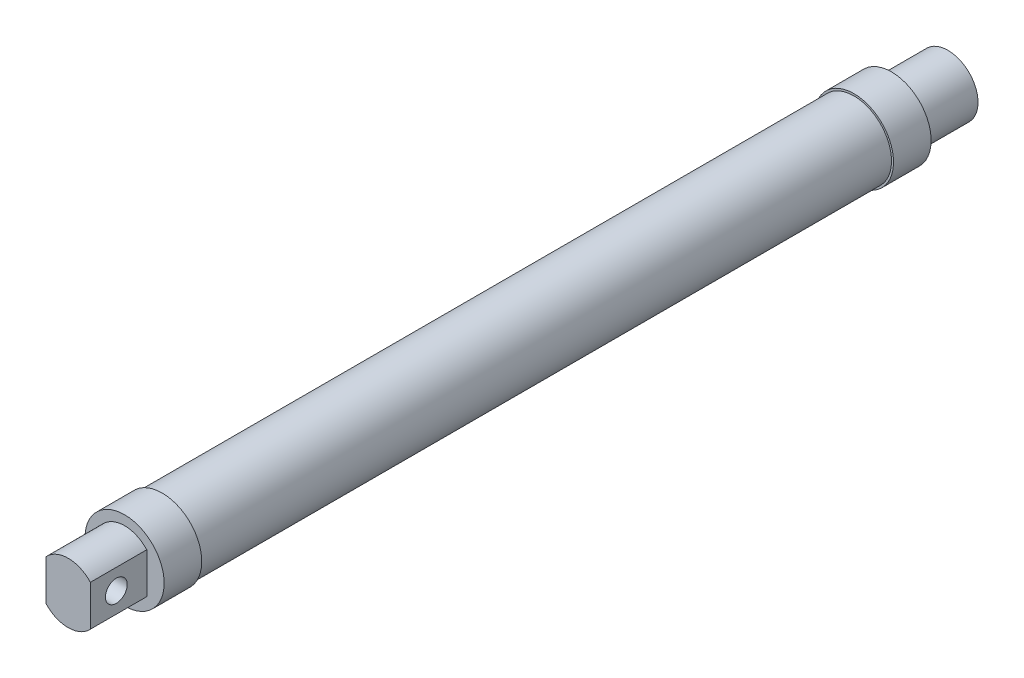
ISO-10303-21;
HEADER;
FILE_DESCRIPTION(('STEP AP214'),'2;1');
FILE_NAME('part.step','',(''),(''),'','','');
FILE_SCHEMA(('AUTOMOTIVE_DESIGN { 1 0 10303 214 1 1 1 1 }'));
ENDSEC;
DATA;
#1=APPLICATION_CONTEXT('core data for automotive mechanical design processes');
#2=APPLICATION_PROTOCOL_DEFINITION('international standard','automotive_design',2000,#1);
#3=PRODUCT_CONTEXT('',#1,'mechanical');
#4=PRODUCT('Part','Part','',(#3));
#5=PRODUCT_RELATED_PRODUCT_CATEGORY('part','',(#4));
#6=PRODUCT_DEFINITION_FORMATION('','',#4);
#7=PRODUCT_DEFINITION_CONTEXT('part definition',#1,'design');
#8=PRODUCT_DEFINITION('design','',#6,#7);
#9=PRODUCT_DEFINITION_SHAPE('','',#8);
#10=(LENGTH_UNIT() NAMED_UNIT(*) SI_UNIT(.MILLI.,.METRE.));
#11=(NAMED_UNIT(*) PLANE_ANGLE_UNIT() SI_UNIT($,.RADIAN.));
#12=(NAMED_UNIT(*) SI_UNIT($,.STERADIAN.) SOLID_ANGLE_UNIT());
#13=UNCERTAINTY_MEASURE_WITH_UNIT(LENGTH_MEASURE(1.E-05),#10,'distance_accuracy_value','');
#14=(GEOMETRIC_REPRESENTATION_CONTEXT(3) GLOBAL_UNCERTAINTY_ASSIGNED_CONTEXT((#13)) GLOBAL_UNIT_ASSIGNED_CONTEXT((#10,
#11,#12)) REPRESENTATION_CONTEXT('',''));
#15=CARTESIAN_POINT('',(0.,0.,0.));
#16=DIRECTION('',(0.,0.,1.));
#17=DIRECTION('',(1.,0.,0.));
#18=AXIS2_PLACEMENT_3D('',#15,#16,#17);
#19=CARTESIAN_POINT('',(0.,0.,-131.173333333333));
#20=DIRECTION('',(0.,0.,-1.));
#21=DIRECTION('',(0.,1.,0.));
#22=AXIS2_PLACEMENT_3D('',#19,#20,#21);
#23=CYLINDRICAL_SURFACE('',#22,7.99999999999998);
#24=DIRECTION('',(0.,0.,1.));
#25=VECTOR('',#24,1.);
#26=CARTESIAN_POINT('',(5.9,5.40277706369605,76.8189421061593));
#27=LINE('',#26,#25);
#28=CARTESIAN_POINT('',(5.9,5.40277706369605,87.8266666666668));
#29=VERTEX_POINT('',#28);
#30=CARTESIAN_POINT('',(5.9,5.40277706369605,102.826666666667));
#31=VERTEX_POINT('',#30);
#32=EDGE_CURVE('E74',#29,#31,#27,.T.);
#33=ORIENTED_EDGE('',*,*,#32,.F.);
#34=CARTESIAN_POINT('',(0.,0.,87.8266666666668));
#35=DIRECTION('',(0.,0.,-1.));
#36=DIRECTION('',(0.,1.,0.));
#37=AXIS2_PLACEMENT_3D('',#34,#35,#36);
#38=CIRCLE('',#37,7.99999999999997);
#39=CARTESIAN_POINT('',(-5.9,5.40277706369599,87.8266666666668));
#40=VERTEX_POINT('',#39);
#41=EDGE_CURVE('E91',#40,#29,#38,.T.);
#42=ORIENTED_EDGE('',*,*,#41,.F.);
#43=DIRECTION('',(0.,0.,1.));
#44=VECTOR('',#43,1.);
#45=CARTESIAN_POINT('',(-5.9,5.40277706369604,76.8189421061593));
#46=LINE('',#45,#44);
#47=CARTESIAN_POINT('',(-5.9,5.40277706369604,102.826666666667));
#48=VERTEX_POINT('',#47);
#49=EDGE_CURVE('E90',#40,#48,#46,.T.);
#50=ORIENTED_EDGE('',*,*,#49,.T.);
#51=CARTESIAN_POINT('',(0.,0.,102.826666666667));
#52=DIRECTION('',(0.,0.,-1.));
#53=DIRECTION('',(0.,1.,0.));
#54=AXIS2_PLACEMENT_3D('',#51,#52,#53);
#55=CIRCLE('',#54,8.);
#56=EDGE_CURVE('E11',#48,#31,#55,.T.);
#57=ORIENTED_EDGE('',*,*,#56,.T.);
#58=EDGE_LOOP('',(#33,#42,#50,#57));
#59=FACE_BOUND('',#58,.T.);
#60=ADVANCED_FACE('F35',(#59),#23,.T.);
#61=CARTESIAN_POINT('',(0.,0.,102.826666666667));
#62=DIRECTION('',(0.,0.,1.));
#63=DIRECTION('',(0.,-1.,0.));
#64=AXIS2_PLACEMENT_3D('',#61,#62,#63);
#65=PLANE('',#64);
#66=DIRECTION('',(0.,-1.,0.));
#67=VECTOR('',#66,1.);
#68=CARTESIAN_POINT('',(5.9,-5.40277706369604,102.826666666667));
#69=LINE('',#68,#67);
#70=CARTESIAN_POINT('',(5.9,-5.40277706369604,102.826666666667));
#71=VERTEX_POINT('',#70);
#72=EDGE_CURVE('E77',#31,#71,#69,.T.);
#73=ORIENTED_EDGE('',*,*,#72,.F.);
#74=ORIENTED_EDGE('',*,*,#56,.F.);
#75=DIRECTION('',(0.,1.,0.));
#76=VECTOR('',#75,1.);
#77=CARTESIAN_POINT('',(-5.9,5.40277706369604,102.826666666667));
#78=LINE('',#77,#76);
#79=CARTESIAN_POINT('',(-5.9,-5.40277706369604,102.826666666667));
#80=VERTEX_POINT('',#79);
#81=EDGE_CURVE('E98',#80,#48,#78,.T.);
#82=ORIENTED_EDGE('',*,*,#81,.F.);
#83=EDGE_CURVE('E43',#71,#80,#55,.T.);
#84=ORIENTED_EDGE('',*,*,#83,.F.);
#85=EDGE_LOOP('',(#73,#74,#82,#84));
#86=FACE_BOUND('',#85,.T.);
#87=ADVANCED_FACE('F37',(#86),#65,.T.);
#88=DIRECTION('',(0.,0.,1.));
#89=VECTOR('',#88,1.);
#90=CARTESIAN_POINT('',(5.9,-5.40277706369604,76.8189421061593));
#91=LINE('',#90,#89);
#92=CARTESIAN_POINT('',(5.9,-5.40277706369598,87.8266666666668));
#93=VERTEX_POINT('',#92);
#94=EDGE_CURVE('E81',#93,#71,#91,.T.);
#95=ORIENTED_EDGE('',*,*,#94,.T.);
#96=ORIENTED_EDGE('',*,*,#83,.T.);
#97=DIRECTION('',(0.,0.,1.));
#98=VECTOR('',#97,1.);
#99=CARTESIAN_POINT('',(-5.9,-5.40277706369604,76.8189421061593));
#100=LINE('',#99,#98);
#101=CARTESIAN_POINT('',(-5.9,-5.40277706369604,87.8266666666668));
#102=VERTEX_POINT('',#101);
#103=EDGE_CURVE('E93',#102,#80,#100,.T.);
#104=ORIENTED_EDGE('',*,*,#103,.F.);
#105=EDGE_CURVE('E125',#93,#102,#38,.T.);
#106=ORIENTED_EDGE('',*,*,#105,.F.);
#107=EDGE_LOOP('',(#95,#96,#104,#106));
#108=FACE_BOUND('',#107,.T.);
#109=ADVANCED_FACE('F132',(#108),#23,.T.);
#110=CARTESIAN_POINT('',(0.,7.99999999999997,87.8266666666668));
#111=DIRECTION('',(0.,0.,1.));
#112=DIRECTION('',(0.,-1.,0.));
#113=AXIS2_PLACEMENT_3D('',#110,#111,#112);
#114=PLANE('',#113);
#115=ORIENTED_EDGE('',*,*,#41,.T.);
#116=DIRECTION('',(0.,1.,0.));
#117=VECTOR('',#116,1.);
#118=CARTESIAN_POINT('',(5.9,-5.40277706369604,87.8266666666668));
#119=LINE('',#118,#117);
#120=EDGE_CURVE('E50',#93,#29,#119,.T.);
#121=ORIENTED_EDGE('',*,*,#120,.F.);
#122=ORIENTED_EDGE('',*,*,#105,.T.);
#123=DIRECTION('',(0.,-1.,0.));
#124=VECTOR('',#123,1.);
#125=CARTESIAN_POINT('',(-5.9,5.40277706369604,87.8266666666668));
#126=LINE('',#125,#124);
#127=EDGE_CURVE('E55',#40,#102,#126,.T.);
#128=ORIENTED_EDGE('',*,*,#127,.F.);
#129=EDGE_LOOP('',(#115,#121,#122,#128));
#130=FACE_BOUND('',#129,.T.);
#131=CARTESIAN_POINT('',(0.,0.,87.8266666666668));
#132=DIRECTION('',(0.,0.,-1.));
#133=DIRECTION('',(0.,1.,0.));
#134=AXIS2_PLACEMENT_3D('',#131,#132,#133);
#135=CIRCLE('',#134,10.525);
#136=CARTESIAN_POINT('',(0.,10.525,87.8266666666668));
#137=VERTEX_POINT('',#136);
#138=EDGE_CURVE('E123',#137,#137,#135,.T.);
#139=ORIENTED_EDGE('',*,*,#138,.F.);
#140=EDGE_LOOP('',(#139));
#141=FACE_BOUND('',#140,.T.);
#142=ADVANCED_FACE('F127',(#130,#141),#114,.T.);
#143=CARTESIAN_POINT('',(0.,0.,-131.173333333333));
#144=DIRECTION('',(0.,0.,-1.));
#145=DIRECTION('',(0.,1.,0.));
#146=AXIS2_PLACEMENT_3D('',#143,#144,#145);
#147=CYLINDRICAL_SURFACE('',#146,10.525);
#148=ORIENTED_EDGE('',*,*,#138,.T.);
#149=EDGE_LOOP('',(#148));
#150=FACE_BOUND('',#149,.T.);
#151=CARTESIAN_POINT('',(0.,0.,77.8266666666668));
#152=DIRECTION('',(0.,0.,-1.));
#153=DIRECTION('',(0.,1.,0.));
#154=AXIS2_PLACEMENT_3D('',#151,#152,#153);
#155=CIRCLE('',#154,10.525);
#156=CARTESIAN_POINT('',(0.,10.525,77.8266666666668));
#157=VERTEX_POINT('',#156);
#158=EDGE_CURVE('E120',#157,#157,#155,.T.);
#159=ORIENTED_EDGE('',*,*,#158,.F.);
#160=EDGE_LOOP('',(#159));
#161=FACE_BOUND('',#160,.T.);
#162=ADVANCED_FACE('F182',(#150,#161),#147,.T.);
#163=CARTESIAN_POINT('',(0.,10.525,77.8266666666668));
#164=DIRECTION('',(0.,0.,-1.));
#165=DIRECTION('',(0.,1.,0.));
#166=AXIS2_PLACEMENT_3D('',#163,#164,#165);
#167=PLANE('',#166);
#168=ORIENTED_EDGE('',*,*,#158,.T.);
#169=EDGE_LOOP('',(#168));
#170=FACE_BOUND('',#169,.T.);
#171=CARTESIAN_POINT('',(0.,0.,77.8266666666668));
#172=DIRECTION('',(0.,0.,-1.));
#173=DIRECTION('',(0.,1.,0.));
#174=AXIS2_PLACEMENT_3D('',#171,#172,#173);
#175=CIRCLE('',#174,9.99999999999997);
#176=CARTESIAN_POINT('',(0.,9.99999999999997,77.8266666666668));
#177=VERTEX_POINT('',#176);
#178=EDGE_CURVE('E117',#177,#177,#175,.T.);
#179=ORIENTED_EDGE('',*,*,#178,.F.);
#180=EDGE_LOOP('',(#179));
#181=FACE_BOUND('',#180,.T.);
#182=ADVANCED_FACE('F186',(#170,#181),#167,.T.);
#183=CARTESIAN_POINT('',(0.,0.,-131.173333333333));
#184=DIRECTION('',(0.,0.,-1.));
#185=DIRECTION('',(0.,1.,0.));
#186=AXIS2_PLACEMENT_3D('',#183,#184,#185);
#187=CYLINDRICAL_SURFACE('',#186,9.99999999999998);
#188=ORIENTED_EDGE('',*,*,#178,.T.);
#189=EDGE_LOOP('',(#188));
#190=FACE_BOUND('',#189,.T.);
#191=CARTESIAN_POINT('',(0.,0.,-106.173333333333));
#192=DIRECTION('',(0.,0.,-1.));
#193=DIRECTION('',(0.,1.,0.));
#194=AXIS2_PLACEMENT_3D('',#191,#192,#193);
#195=CIRCLE('',#194,9.99999999999998);
#196=CARTESIAN_POINT('',(0.,9.99999999999998,-106.173333333333));
#197=VERTEX_POINT('',#196);
#198=EDGE_CURVE('E114',#197,#197,#195,.T.);
#199=ORIENTED_EDGE('',*,*,#198,.F.);
#200=EDGE_LOOP('',(#199));
#201=FACE_BOUND('',#200,.T.);
#202=ADVANCED_FACE('F192',(#190,#201),#187,.T.);
#203=CARTESIAN_POINT('',(0.,9.99999999999998,-106.173333333333));
#204=DIRECTION('',(0.,0.,1.));
#205=DIRECTION('',(0.,-1.,0.));
#206=AXIS2_PLACEMENT_3D('',#203,#204,#205);
#207=PLANE('',#206);
#208=ORIENTED_EDGE('',*,*,#198,.T.);
#209=EDGE_LOOP('',(#208));
#210=FACE_BOUND('',#209,.T.);
#211=CARTESIAN_POINT('',(0.,0.,-106.173333333333));
#212=DIRECTION('',(0.,0.,-1.));
#213=DIRECTION('',(0.,1.,0.));
#214=AXIS2_PLACEMENT_3D('',#211,#212,#213);
#215=CIRCLE('',#214,10.525);
#216=CARTESIAN_POINT('',(0.,10.5249999999999,-106.173333333333));
#217=VERTEX_POINT('',#216);
#218=EDGE_CURVE('E111',#217,#217,#215,.T.);
#219=ORIENTED_EDGE('',*,*,#218,.F.);
#220=EDGE_LOOP('',(#219));
#221=FACE_BOUND('',#220,.T.);
#222=ADVANCED_FACE('F196',(#210,#221),#207,.T.);
#223=CARTESIAN_POINT('',(0.,0.,-131.173333333333));
#224=DIRECTION('',(0.,0.,-1.));
#225=DIRECTION('',(0.,1.,0.));
#226=AXIS2_PLACEMENT_3D('',#223,#224,#225);
#227=CYLINDRICAL_SURFACE('',#226,10.525);
#228=ORIENTED_EDGE('',*,*,#218,.T.);
#229=EDGE_LOOP('',(#228));
#230=FACE_BOUND('',#229,.T.);
#231=CARTESIAN_POINT('',(0.,0.,-116.173333333333));
#232=DIRECTION('',(0.,0.,-1.));
#233=DIRECTION('',(0.,1.,0.));
#234=AXIS2_PLACEMENT_3D('',#231,#232,#233);
#235=CIRCLE('',#234,10.525);
#236=CARTESIAN_POINT('',(0.,10.5249999999999,-116.173333333333));
#237=VERTEX_POINT('',#236);
#238=EDGE_CURVE('E108',#237,#237,#235,.T.);
#239=ORIENTED_EDGE('',*,*,#238,.F.);
#240=EDGE_LOOP('',(#239));
#241=FACE_BOUND('',#240,.T.);
#242=ADVANCED_FACE('F170',(#230,#241),#227,.T.);
#243=CARTESIAN_POINT('',(0.,10.5249999999999,-116.173333333333));
#244=DIRECTION('',(0.,0.,-1.));
#245=DIRECTION('',(0.,1.,0.));
#246=AXIS2_PLACEMENT_3D('',#243,#244,#245);
#247=PLANE('',#246);
#248=ORIENTED_EDGE('',*,*,#238,.T.);
#249=EDGE_LOOP('',(#248));
#250=FACE_BOUND('',#249,.T.);
#251=CARTESIAN_POINT('',(0.,0.,-116.173333333333));
#252=DIRECTION('',(0.,0.,-1.));
#253=DIRECTION('',(0.,1.,0.));
#254=AXIS2_PLACEMENT_3D('',#251,#252,#253);
#255=CIRCLE('',#254,8.);
#256=CARTESIAN_POINT('',(0.,8.,-116.173333333333));
#257=VERTEX_POINT('',#256);
#258=EDGE_CURVE('E105',#257,#257,#255,.T.);
#259=ORIENTED_EDGE('',*,*,#258,.F.);
#260=EDGE_LOOP('',(#259));
#261=FACE_BOUND('',#260,.T.);
#262=ADVANCED_FACE('F164',(#250,#261),#247,.T.);
#263=CARTESIAN_POINT('',(0.,0.,-131.173333333333));
#264=DIRECTION('',(0.,0.,-1.));
#265=DIRECTION('',(0.,1.,0.));
#266=AXIS2_PLACEMENT_3D('',#263,#264,#265);
#267=CYLINDRICAL_SURFACE('',#266,8.);
#268=ORIENTED_EDGE('',*,*,#258,.T.);
#269=EDGE_LOOP('',(#268));
#270=FACE_BOUND('',#269,.T.);
#271=CARTESIAN_POINT('',(0.,0.,-131.173333333333));
#272=DIRECTION('',(0.,0.,-1.));
#273=DIRECTION('',(0.,1.,0.));
#274=AXIS2_PLACEMENT_3D('',#271,#272,#273);
#275=CIRCLE('',#274,8.);
#276=CARTESIAN_POINT('',(0.,8.,-131.173333333333));
#277=VERTEX_POINT('',#276);
#278=EDGE_CURVE('E95',#277,#277,#275,.T.);
#279=ORIENTED_EDGE('',*,*,#278,.F.);
#280=EDGE_LOOP('',(#279));
#281=FACE_BOUND('',#280,.T.);
#282=ADVANCED_FACE('F159',(#270,#281),#267,.T.);
#283=CARTESIAN_POINT('',(0.,8.,-131.173333333333));
#284=DIRECTION('',(0.,0.,-1.));
#285=DIRECTION('',(0.,1.,0.));
#286=AXIS2_PLACEMENT_3D('',#283,#284,#285);
#287=PLANE('',#286);
#288=CARTESIAN_POINT('',(0.,0.,-131.173333333333));
#289=DIRECTION('',(0.,0.,-1.));
#290=DIRECTION('',(0.,1.,0.));
#291=AXIS2_PLACEMENT_3D('',#288,#289,#290);
#292=CIRCLE('',#291,3.);
#293=CARTESIAN_POINT('',(0.,3.,-131.173333333333));
#294=VERTEX_POINT('',#293);
#295=EDGE_CURVE('E141',#294,#294,#292,.T.);
#296=ORIENTED_EDGE('',*,*,#295,.F.);
#297=EDGE_LOOP('',(#296));
#298=FACE_BOUND('',#297,.T.);
#299=ORIENTED_EDGE('',*,*,#278,.T.);
#300=EDGE_LOOP('',(#299));
#301=FACE_BOUND('',#300,.T.);
#302=ADVANCED_FACE('F156',(#298,#301),#287,.T.);
#303=CARTESIAN_POINT('',(-5.9,5.40277706369604,76.8189421061593));
#304=DIRECTION('',(1.,0.,0.));
#305=DIRECTION('',(0.,0.,-1.));
#306=AXIS2_PLACEMENT_3D('',#303,#304,#305);
#307=PLANE('',#306);
#308=CARTESIAN_POINT('',(-5.9,0.,95.9266666666668));
#309=DIRECTION('',(1.,0.,0.));
#310=DIRECTION('',(0.,0.,-1.));
#311=AXIS2_PLACEMENT_3D('',#308,#309,#310);
#312=CIRCLE('',#311,2.9);
#313=CARTESIAN_POINT('',(-5.9,0.,93.0266666666668));
#314=VERTEX_POINT('',#313);
#315=EDGE_CURVE('E87',#314,#314,#312,.T.);
#316=ORIENTED_EDGE('',*,*,#315,.T.);
#317=EDGE_LOOP('',(#316));
#318=FACE_BOUND('',#317,.T.);
#319=ORIENTED_EDGE('',*,*,#127,.T.);
#320=ORIENTED_EDGE('',*,*,#103,.T.);
#321=ORIENTED_EDGE('',*,*,#81,.T.);
#322=ORIENTED_EDGE('',*,*,#49,.F.);
#323=EDGE_LOOP('',(#319,#320,#321,#322));
#324=FACE_BOUND('',#323,.T.);
#325=ADVANCED_FACE('F131',(#318,#324),#307,.F.);
#326=CARTESIAN_POINT('',(5.9,-5.40277706369604,76.8189421061593));
#327=DIRECTION('',(-1.,0.,0.));
#328=DIRECTION('',(0.,-1.,0.));
#329=AXIS2_PLACEMENT_3D('',#326,#327,#328);
#330=PLANE('',#329);
#331=CARTESIAN_POINT('',(5.9,0.,95.9266666666668));
#332=DIRECTION('',(1.,0.,0.));
#333=DIRECTION('',(0.,1.,0.));
#334=AXIS2_PLACEMENT_3D('',#331,#332,#333);
#335=CIRCLE('',#334,2.9);
#336=CARTESIAN_POINT('',(5.9,2.9,95.9266666666668));
#337=VERTEX_POINT('',#336);
#338=EDGE_CURVE('E137',#337,#337,#335,.T.);
#339=ORIENTED_EDGE('',*,*,#338,.F.);
#340=EDGE_LOOP('',(#339));
#341=FACE_BOUND('',#340,.T.);
#342=ORIENTED_EDGE('',*,*,#120,.T.);
#343=ORIENTED_EDGE('',*,*,#32,.T.);
#344=ORIENTED_EDGE('',*,*,#72,.T.);
#345=ORIENTED_EDGE('',*,*,#94,.F.);
#346=EDGE_LOOP('',(#342,#343,#344,#345));
#347=FACE_BOUND('',#346,.T.);
#348=ADVANCED_FACE('F76',(#341,#347),#330,.F.);
#349=CARTESIAN_POINT('',(-10.525,0.,95.9266666666668));
#350=DIRECTION('',(1.,0.,0.));
#351=DIRECTION('',(0.,1.,0.));
#352=AXIS2_PLACEMENT_3D('',#349,#350,#351);
#353=CYLINDRICAL_SURFACE('',#352,2.9);
#354=ORIENTED_EDGE('',*,*,#338,.T.);
#355=EDGE_LOOP('',(#354));
#356=FACE_BOUND('',#355,.T.);
#357=ORIENTED_EDGE('',*,*,#315,.F.);
#358=EDGE_LOOP('',(#357));
#359=FACE_BOUND('',#358,.T.);
#360=ADVANCED_FACE('F152',(#356,#359),#353,.F.);
#361=CARTESIAN_POINT('',(0.,0.,48.8266666666668));
#362=DIRECTION('',(0.,0.,-1.));
#363=DIRECTION('',(0.,1.,0.));
#364=AXIS2_PLACEMENT_3D('',#361,#362,#363);
#365=CYLINDRICAL_SURFACE('',#364,3.);
#366=CARTESIAN_POINT('',(0.,0.,48.8266666666668));
#367=DIRECTION('',(0.,0.,-1.));
#368=DIRECTION('',(0.,1.,0.));
#369=AXIS2_PLACEMENT_3D('',#366,#367,#368);
#370=CIRCLE('',#369,3.);
#371=CARTESIAN_POINT('',(0.,3.,48.8266666666668));
#372=VERTEX_POINT('',#371);
#373=EDGE_CURVE('E140',#372,#372,#370,.T.);
#374=ORIENTED_EDGE('',*,*,#373,.F.);
#375=EDGE_LOOP('',(#374));
#376=FACE_BOUND('',#375,.T.);
#377=ORIENTED_EDGE('',*,*,#295,.T.);
#378=EDGE_LOOP('',(#377));
#379=FACE_BOUND('',#378,.T.);
#380=ADVANCED_FACE('F149',(#376,#379),#365,.F.);
#381=CARTESIAN_POINT('',(0.,0.,48.8266666666668));
#382=DIRECTION('',(0.,0.,-1.));
#383=DIRECTION('',(0.,1.,0.));
#384=AXIS2_PLACEMENT_3D('',#381,#382,#383);
#385=PLANE('',#384);
#386=ORIENTED_EDGE('',*,*,#373,.T.);
#387=EDGE_LOOP('',(#386));
#388=FACE_BOUND('',#387,.T.);
#389=ADVANCED_FACE('F147',(#388),#385,.T.);
#390=CLOSED_SHELL('',(#60,#87,#109,#142,#162,#182,#202,#222,#242,#262,#282,#302,#325,#348,#360,
#380,#389));
#391=MANIFOLD_SOLID_BREP('B2',#390);
#392=ADVANCED_BREP_SHAPE_REPRESENTATION('',(#18,#391),#14);
#393=SHAPE_DEFINITION_REPRESENTATION(#9,#392);
ENDSEC;
END-ISO-10303-21;
